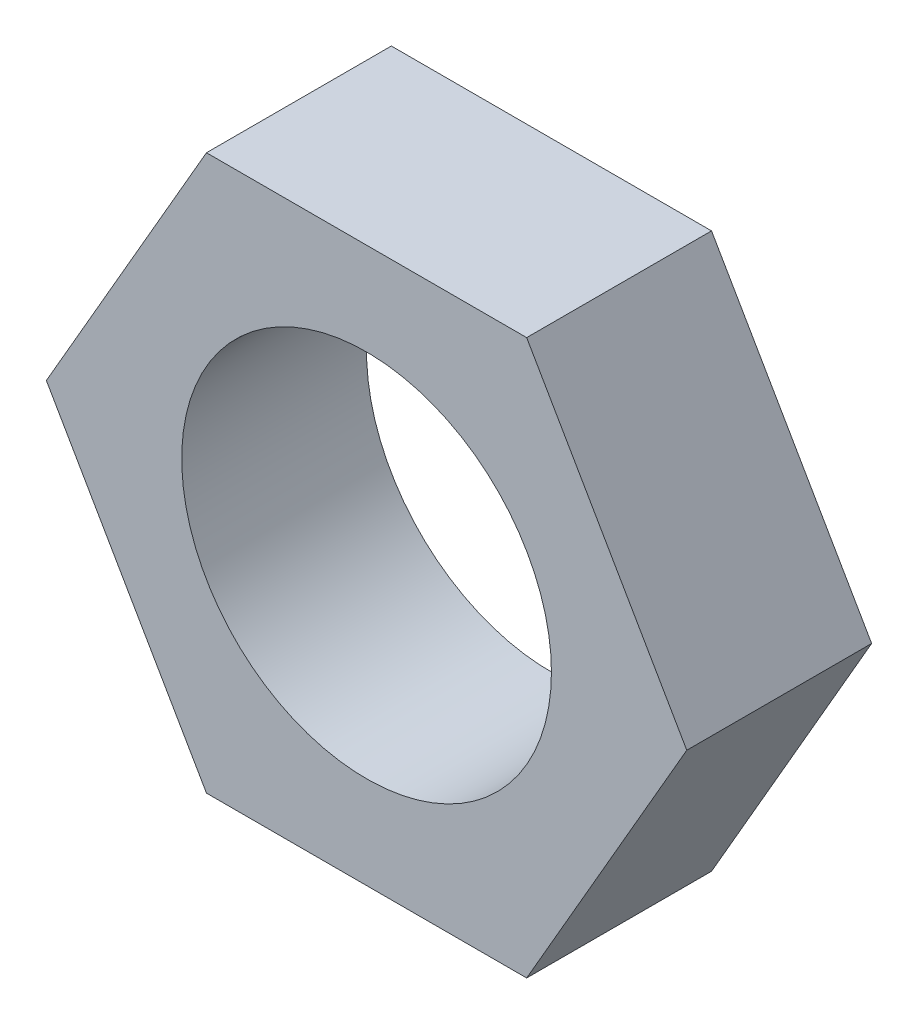
ISO-10303-21;
HEADER;
FILE_DESCRIPTION(('STEP AP214'),'2;1');
FILE_NAME('part.step','',(''),(''),'','','');
FILE_SCHEMA(('AUTOMOTIVE_DESIGN { 1 0 10303 214 1 1 1 1 }'));
ENDSEC;
DATA;
#1=APPLICATION_CONTEXT('core data for automotive mechanical design processes');
#2=APPLICATION_PROTOCOL_DEFINITION('international standard','automotive_design',2000,#1);
#3=PRODUCT_CONTEXT('',#1,'mechanical');
#4=PRODUCT('Part','Part','',(#3));
#5=PRODUCT_RELATED_PRODUCT_CATEGORY('part','',(#4));
#6=PRODUCT_DEFINITION_FORMATION('','',#4);
#7=PRODUCT_DEFINITION_CONTEXT('part definition',#1,'design');
#8=PRODUCT_DEFINITION('design','',#6,#7);
#9=PRODUCT_DEFINITION_SHAPE('','',#8);
#10=(LENGTH_UNIT() NAMED_UNIT(*) SI_UNIT(.MILLI.,.METRE.));
#11=(NAMED_UNIT(*) PLANE_ANGLE_UNIT() SI_UNIT($,.RADIAN.));
#12=(NAMED_UNIT(*) SI_UNIT($,.STERADIAN.) SOLID_ANGLE_UNIT());
#13=UNCERTAINTY_MEASURE_WITH_UNIT(LENGTH_MEASURE(1.E-05),#10,'distance_accuracy_value','');
#14=(GEOMETRIC_REPRESENTATION_CONTEXT(3) GLOBAL_UNCERTAINTY_ASSIGNED_CONTEXT((#13)) GLOBAL_UNIT_ASSIGNED_CONTEXT((#10,
#11,#12)) REPRESENTATION_CONTEXT('',''));
#15=CARTESIAN_POINT('',(0.,0.,0.));
#16=DIRECTION('',(0.,0.,1.));
#17=DIRECTION('',(1.,0.,0.));
#18=AXIS2_PLACEMENT_3D('',#15,#16,#17);
#19=CARTESIAN_POINT('',(0.,0.,6.35));
#20=DIRECTION('',(0.,0.,1.));
#21=DIRECTION('',(1.,0.,0.));
#22=AXIS2_PLACEMENT_3D('',#19,#20,#21);
#23=PLANE('',#22);
#24=DIRECTION('',(1.,0.,0.));
#25=VECTOR('',#24,1.);
#26=CARTESIAN_POINT('',(-5.49926131403119,-9.525,6.35));
#27=LINE('',#26,#25);
#28=CARTESIAN_POINT('',(-5.49926131403119,-9.525,6.35));
#29=VERTEX_POINT('',#28);
#30=CARTESIAN_POINT('',(5.49926131403119,-9.525,6.35));
#31=VERTEX_POINT('',#30);
#32=EDGE_CURVE('E130',#29,#31,#27,.T.);
#33=ORIENTED_EDGE('',*,*,#32,.T.);
#34=DIRECTION('',(0.5,0.866025403784439,0.));
#35=VECTOR('',#34,1.);
#36=CARTESIAN_POINT('',(5.49926131403119,-9.525,6.35));
#37=LINE('',#36,#35);
#38=CARTESIAN_POINT('',(10.9985226280624,0.,6.35));
#39=VERTEX_POINT('',#38);
#40=EDGE_CURVE('E88',#31,#39,#37,.T.);
#41=ORIENTED_EDGE('',*,*,#40,.T.);
#42=DIRECTION('',(-0.5,0.866025403784438,0.));
#43=VECTOR('',#42,1.);
#44=CARTESIAN_POINT('',(10.9985226280624,0.,6.35));
#45=LINE('',#44,#43);
#46=CARTESIAN_POINT('',(5.49926131403118,9.525,6.35));
#47=VERTEX_POINT('',#46);
#48=EDGE_CURVE('E101',#39,#47,#45,.T.);
#49=ORIENTED_EDGE('',*,*,#48,.T.);
#50=DIRECTION('',(-1.,0.,0.));
#51=VECTOR('',#50,1.);
#52=CARTESIAN_POINT('',(5.49926131403118,9.525,6.35));
#53=LINE('',#52,#51);
#54=CARTESIAN_POINT('',(-5.49926131403119,9.525,6.35));
#55=VERTEX_POINT('',#54);
#56=EDGE_CURVE('E95',#47,#55,#53,.T.);
#57=ORIENTED_EDGE('',*,*,#56,.T.);
#58=DIRECTION('',(-0.5,-0.866025403784439,0.));
#59=VECTOR('',#58,1.);
#60=CARTESIAN_POINT('',(-5.49926131403119,9.525,6.35));
#61=LINE('',#60,#59);
#62=CARTESIAN_POINT('',(-10.9985226280624,0.,6.35));
#63=VERTEX_POINT('',#62);
#64=EDGE_CURVE('E99',#55,#63,#61,.T.);
#65=ORIENTED_EDGE('',*,*,#64,.T.);
#66=DIRECTION('',(0.5,-0.866025403784439,0.));
#67=VECTOR('',#66,1.);
#68=CARTESIAN_POINT('',(-10.9985226280624,0.,6.35));
#69=LINE('',#68,#67);
#70=EDGE_CURVE('E51',#63,#29,#69,.T.);
#71=ORIENTED_EDGE('',*,*,#70,.T.);
#72=EDGE_LOOP('',(#33,#41,#49,#57,#65,#71));
#73=FACE_BOUND('',#72,.T.);
#74=CARTESIAN_POINT('',(0.,0.,6.35));
#75=DIRECTION('',(0.,0.,1.));
#76=DIRECTION('',(1.,0.,0.));
#77=AXIS2_PLACEMENT_3D('',#74,#75,#76);
#78=CIRCLE('',#77,6.35);
#79=CARTESIAN_POINT('',(6.35,0.,6.35));
#80=VERTEX_POINT('',#79);
#81=EDGE_CURVE('E123',#80,#80,#78,.T.);
#82=ORIENTED_EDGE('',*,*,#81,.F.);
#83=EDGE_LOOP('',(#82));
#84=FACE_BOUND('',#83,.T.);
#85=ADVANCED_FACE('F34',(#73,#84),#23,.T.);
#86=CARTESIAN_POINT('',(0.,0.,0.));
#87=DIRECTION('',(0.,0.,1.));
#88=DIRECTION('',(1.,0.,0.));
#89=AXIS2_PLACEMENT_3D('',#86,#87,#88);
#90=PLANE('',#89);
#91=DIRECTION('',(1.,0.,0.));
#92=VECTOR('',#91,1.);
#93=CARTESIAN_POINT('',(-5.49926131403119,-9.525,0.));
#94=LINE('',#93,#92);
#95=CARTESIAN_POINT('',(-5.49926131403119,-9.525,0.));
#96=VERTEX_POINT('',#95);
#97=CARTESIAN_POINT('',(5.49926131403119,-9.525,0.));
#98=VERTEX_POINT('',#97);
#99=EDGE_CURVE('E119',#96,#98,#94,.T.);
#100=ORIENTED_EDGE('',*,*,#99,.F.);
#101=DIRECTION('',(0.5,-0.866025403784439,0.));
#102=VECTOR('',#101,1.);
#103=CARTESIAN_POINT('',(-10.9985226280624,0.,0.));
#104=LINE('',#103,#102);
#105=CARTESIAN_POINT('',(-10.9985226280624,0.,0.));
#106=VERTEX_POINT('',#105);
#107=EDGE_CURVE('E80',#106,#96,#104,.T.);
#108=ORIENTED_EDGE('',*,*,#107,.F.);
#109=DIRECTION('',(-0.5,-0.866025403784439,0.));
#110=VECTOR('',#109,1.);
#111=CARTESIAN_POINT('',(-5.49926131403119,9.525,0.));
#112=LINE('',#111,#110);
#113=CARTESIAN_POINT('',(-5.49926131403119,9.525,0.));
#114=VERTEX_POINT('',#113);
#115=EDGE_CURVE('E74',#114,#106,#112,.T.);
#116=ORIENTED_EDGE('',*,*,#115,.F.);
#117=DIRECTION('',(-1.,0.,0.));
#118=VECTOR('',#117,1.);
#119=CARTESIAN_POINT('',(5.49926131403118,9.525,0.));
#120=LINE('',#119,#118);
#121=CARTESIAN_POINT('',(5.49926131403118,9.525,0.));
#122=VERTEX_POINT('',#121);
#123=EDGE_CURVE('E109',#122,#114,#120,.T.);
#124=ORIENTED_EDGE('',*,*,#123,.F.);
#125=DIRECTION('',(-0.5,0.866025403784438,0.));
#126=VECTOR('',#125,1.);
#127=CARTESIAN_POINT('',(10.9985226280624,0.,0.));
#128=LINE('',#127,#126);
#129=CARTESIAN_POINT('',(10.9985226280624,0.,0.));
#130=VERTEX_POINT('',#129);
#131=EDGE_CURVE('E125',#130,#122,#128,.T.);
#132=ORIENTED_EDGE('',*,*,#131,.F.);
#133=DIRECTION('',(0.5,0.866025403784439,0.));
#134=VECTOR('',#133,1.);
#135=CARTESIAN_POINT('',(5.49926131403119,-9.525,0.));
#136=LINE('',#135,#134);
#137=EDGE_CURVE('E122',#98,#130,#136,.T.);
#138=ORIENTED_EDGE('',*,*,#137,.F.);
#139=EDGE_LOOP('',(#100,#108,#116,#124,#132,#138));
#140=FACE_BOUND('',#139,.T.);
#141=CARTESIAN_POINT('',(0.,0.,0.));
#142=DIRECTION('',(0.,0.,1.));
#143=DIRECTION('',(1.,0.,0.));
#144=AXIS2_PLACEMENT_3D('',#141,#142,#143);
#145=CIRCLE('',#144,6.35);
#146=CARTESIAN_POINT('',(6.35,0.,0.));
#147=VERTEX_POINT('',#146);
#148=EDGE_CURVE('E223',#147,#147,#145,.T.);
#149=ORIENTED_EDGE('',*,*,#148,.T.);
#150=EDGE_LOOP('',(#149));
#151=FACE_BOUND('',#150,.T.);
#152=ADVANCED_FACE('F139',(#140,#151),#90,.F.);
#153=CARTESIAN_POINT('',(-5.49926131403119,-9.525,6.35));
#154=DIRECTION('',(0.,1.,0.));
#155=DIRECTION('',(-1.,0.,0.));
#156=AXIS2_PLACEMENT_3D('',#153,#154,#155);
#157=PLANE('',#156);
#158=ORIENTED_EDGE('',*,*,#99,.T.);
#159=DIRECTION('',(0.,0.,-1.));
#160=VECTOR('',#159,1.);
#161=CARTESIAN_POINT('',(5.49926131403119,-9.525,6.35));
#162=LINE('',#161,#160);
#163=EDGE_CURVE('E11',#31,#98,#162,.T.);
#164=ORIENTED_EDGE('',*,*,#163,.F.);
#165=ORIENTED_EDGE('',*,*,#32,.F.);
#166=DIRECTION('',(0.,0.,-1.));
#167=VECTOR('',#166,1.);
#168=CARTESIAN_POINT('',(-5.49926131403119,-9.525,6.35));
#169=LINE('',#168,#167);
#170=EDGE_CURVE('E115',#29,#96,#169,.T.);
#171=ORIENTED_EDGE('',*,*,#170,.T.);
#172=EDGE_LOOP('',(#158,#164,#165,#171));
#173=FACE_BOUND('',#172,.T.);
#174=ADVANCED_FACE('F36',(#173),#157,.F.);
#175=CARTESIAN_POINT('',(5.49926131403119,-9.525,6.35));
#176=DIRECTION('',(-0.866025403784439,0.5,0.));
#177=DIRECTION('',(-0.5,-0.866025403784439,0.));
#178=AXIS2_PLACEMENT_3D('',#175,#176,#177);
#179=PLANE('',#178);
#180=ORIENTED_EDGE('',*,*,#137,.T.);
#181=DIRECTION('',(0.,0.,-1.));
#182=VECTOR('',#181,1.);
#183=CARTESIAN_POINT('',(10.9985226280624,0.,6.35));
#184=LINE('',#183,#182);
#185=EDGE_CURVE('E43',#39,#130,#184,.T.);
#186=ORIENTED_EDGE('',*,*,#185,.F.);
#187=ORIENTED_EDGE('',*,*,#40,.F.);
#188=ORIENTED_EDGE('',*,*,#163,.T.);
#189=EDGE_LOOP('',(#180,#186,#187,#188));
#190=FACE_BOUND('',#189,.T.);
#191=ADVANCED_FACE('F164',(#190),#179,.F.);
#192=CARTESIAN_POINT('',(10.9985226280624,0.,6.35));
#193=DIRECTION('',(-0.866025403784438,-0.5,0.));
#194=DIRECTION('',(0.5,-0.866025403784439,0.));
#195=AXIS2_PLACEMENT_3D('',#192,#193,#194);
#196=PLANE('',#195);
#197=ORIENTED_EDGE('',*,*,#131,.T.);
#198=DIRECTION('',(0.,0.,-1.));
#199=VECTOR('',#198,1.);
#200=CARTESIAN_POINT('',(5.49926131403118,9.525,6.35));
#201=LINE('',#200,#199);
#202=EDGE_CURVE('E110',#47,#122,#201,.T.);
#203=ORIENTED_EDGE('',*,*,#202,.F.);
#204=ORIENTED_EDGE('',*,*,#48,.F.);
#205=ORIENTED_EDGE('',*,*,#185,.T.);
#206=EDGE_LOOP('',(#197,#203,#204,#205));
#207=FACE_BOUND('',#206,.T.);
#208=ADVANCED_FACE('F136',(#207),#196,.F.);
#209=CARTESIAN_POINT('',(5.49926131403118,9.525,6.35));
#210=DIRECTION('',(0.,-1.,0.));
#211=DIRECTION('',(1.,0.,0.));
#212=AXIS2_PLACEMENT_3D('',#209,#210,#211);
#213=PLANE('',#212);
#214=ORIENTED_EDGE('',*,*,#123,.T.);
#215=DIRECTION('',(0.,0.,-1.));
#216=VECTOR('',#215,1.);
#217=CARTESIAN_POINT('',(-5.49926131403119,9.525,6.35));
#218=LINE('',#217,#216);
#219=EDGE_CURVE('E106',#55,#114,#218,.T.);
#220=ORIENTED_EDGE('',*,*,#219,.F.);
#221=ORIENTED_EDGE('',*,*,#56,.F.);
#222=ORIENTED_EDGE('',*,*,#202,.T.);
#223=EDGE_LOOP('',(#214,#220,#221,#222));
#224=FACE_BOUND('',#223,.T.);
#225=ADVANCED_FACE('F107',(#224),#213,.F.);
#226=CARTESIAN_POINT('',(-5.49926131403119,9.525,6.35));
#227=DIRECTION('',(0.866025403784439,-0.5,0.));
#228=DIRECTION('',(0.5,0.866025403784439,0.));
#229=AXIS2_PLACEMENT_3D('',#226,#227,#228);
#230=PLANE('',#229);
#231=ORIENTED_EDGE('',*,*,#115,.T.);
#232=DIRECTION('',(0.,0.,-1.));
#233=VECTOR('',#232,1.);
#234=CARTESIAN_POINT('',(-10.9985226280624,0.,6.35));
#235=LINE('',#234,#233);
#236=EDGE_CURVE('E111',#63,#106,#235,.T.);
#237=ORIENTED_EDGE('',*,*,#236,.F.);
#238=ORIENTED_EDGE('',*,*,#64,.F.);
#239=ORIENTED_EDGE('',*,*,#219,.T.);
#240=EDGE_LOOP('',(#231,#237,#238,#239));
#241=FACE_BOUND('',#240,.T.);
#242=ADVANCED_FACE('F113',(#241),#230,.F.);
#243=CARTESIAN_POINT('',(-10.9985226280624,0.,6.35));
#244=DIRECTION('',(0.866025403784439,0.5,0.));
#245=DIRECTION('',(-0.5,0.866025403784439,0.));
#246=AXIS2_PLACEMENT_3D('',#243,#244,#245);
#247=PLANE('',#246);
#248=ORIENTED_EDGE('',*,*,#107,.T.);
#249=ORIENTED_EDGE('',*,*,#170,.F.);
#250=ORIENTED_EDGE('',*,*,#70,.F.);
#251=ORIENTED_EDGE('',*,*,#236,.T.);
#252=EDGE_LOOP('',(#248,#249,#250,#251));
#253=FACE_BOUND('',#252,.T.);
#254=ADVANCED_FACE('F144',(#253),#247,.F.);
#255=CARTESIAN_POINT('',(0.,0.,6.35));
#256=DIRECTION('',(0.,0.,-1.));
#257=DIRECTION('',(-1.,0.,0.));
#258=AXIS2_PLACEMENT_3D('',#255,#256,#257);
#259=CYLINDRICAL_SURFACE('',#258,6.35);
#260=ORIENTED_EDGE('',*,*,#81,.T.);
#261=EDGE_LOOP('',(#260));
#262=FACE_BOUND('',#261,.T.);
#263=ORIENTED_EDGE('',*,*,#148,.F.);
#264=EDGE_LOOP('',(#263));
#265=FACE_BOUND('',#264,.T.);
#266=ADVANCED_FACE('F146',(#262,#265),#259,.F.);
#267=CLOSED_SHELL('',(#85,#152,#174,#191,#208,#225,#242,#254,#266));
#268=MANIFOLD_SOLID_BREP('B2',#267);
#269=ADVANCED_BREP_SHAPE_REPRESENTATION('',(#18,#268),#14);
#270=SHAPE_DEFINITION_REPRESENTATION(#9,#269);
ENDSEC;
END-ISO-10303-21;
